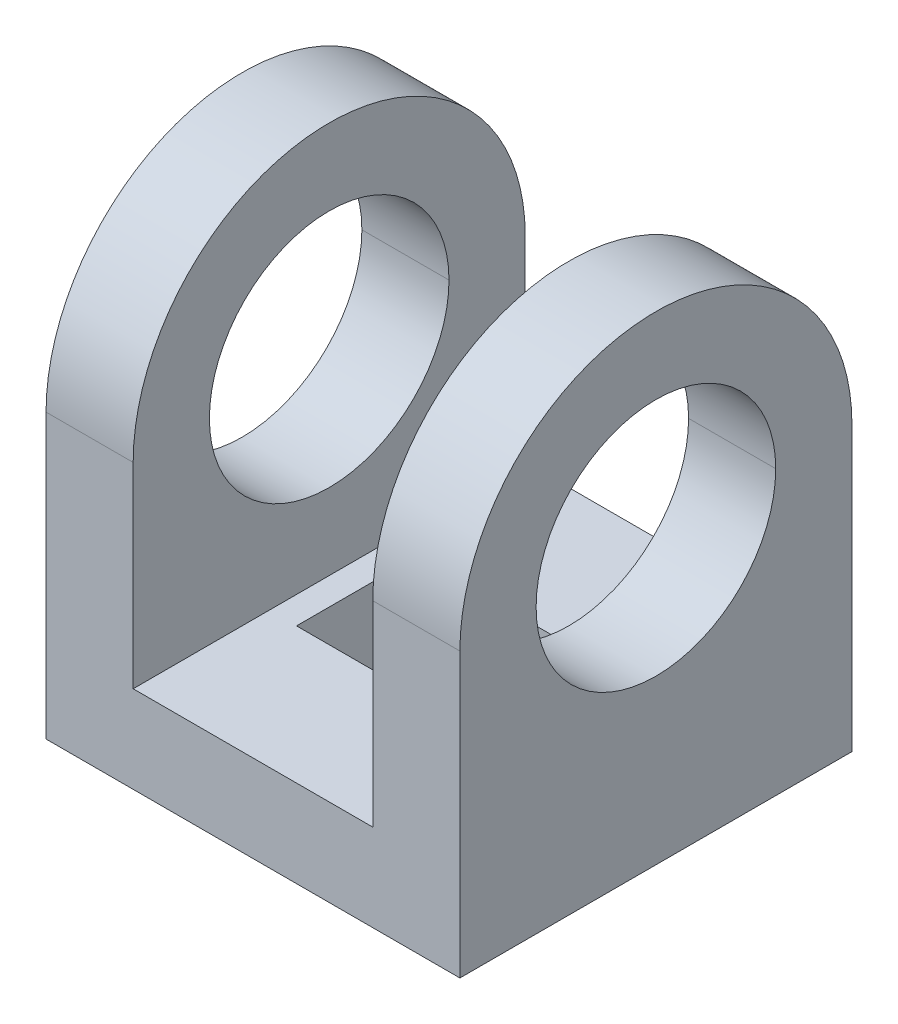
ISO-10303-21;
HEADER;
FILE_DESCRIPTION(('STEP AP214'),'2;1');
FILE_NAME('part.step','',(''),(''),'','','');
FILE_SCHEMA(('AUTOMOTIVE_DESIGN { 1 0 10303 214 1 1 1 1 }'));
ENDSEC;
DATA;
#1=APPLICATION_CONTEXT('core data for automotive mechanical design processes');
#2=APPLICATION_PROTOCOL_DEFINITION('international standard','automotive_design',2000,#1);
#3=PRODUCT_CONTEXT('',#1,'mechanical');
#4=PRODUCT('Part','Part','',(#3));
#5=PRODUCT_RELATED_PRODUCT_CATEGORY('part','',(#4));
#6=PRODUCT_DEFINITION_FORMATION('','',#4);
#7=PRODUCT_DEFINITION_CONTEXT('part definition',#1,'design');
#8=PRODUCT_DEFINITION('design','',#6,#7);
#9=PRODUCT_DEFINITION_SHAPE('','',#8);
#10=(LENGTH_UNIT() NAMED_UNIT(*) SI_UNIT(.MILLI.,.METRE.));
#11=(NAMED_UNIT(*) PLANE_ANGLE_UNIT() SI_UNIT($,.RADIAN.));
#12=(NAMED_UNIT(*) SI_UNIT($,.STERADIAN.) SOLID_ANGLE_UNIT());
#13=UNCERTAINTY_MEASURE_WITH_UNIT(LENGTH_MEASURE(1.E-05),#10,'distance_accuracy_value','');
#14=(GEOMETRIC_REPRESENTATION_CONTEXT(3) GLOBAL_UNCERTAINTY_ASSIGNED_CONTEXT((#13)) GLOBAL_UNIT_ASSIGNED_CONTEXT((#10,
#11,#12)) REPRESENTATION_CONTEXT('',''));
#15=CARTESIAN_POINT('',(0.,0.,0.));
#16=DIRECTION('',(0.,0.,1.));
#17=DIRECTION('',(1.,0.,0.));
#18=AXIS2_PLACEMENT_3D('',#15,#16,#17);
#19=CARTESIAN_POINT('',(5.25,22.,-11.75));
#20=DIRECTION('',(0.,0.,-1.));
#21=DIRECTION('',(-1.,0.,0.));
#22=AXIS2_PLACEMENT_3D('',#19,#20,#21);
#23=PLANE('',#22);
#24=DIRECTION('',(0.,-1.,0.));
#25=VECTOR('',#24,1.);
#26=CARTESIAN_POINT('',(5.25,22.,-11.75));
#27=LINE('',#26,#25);
#28=CARTESIAN_POINT('',(5.25,4.,-11.75));
#29=VERTEX_POINT('',#28);
#30=CARTESIAN_POINT('',(5.25,0.,-11.75));
#31=VERTEX_POINT('',#30);
#32=EDGE_CURVE('E191',#29,#31,#27,.T.);
#33=ORIENTED_EDGE('',*,*,#32,.T.);
#34=DIRECTION('',(1.,0.,0.));
#35=VECTOR('',#34,1.);
#36=CARTESIAN_POINT('',(5.25,0.,-11.75));
#37=LINE('',#36,#35);
#38=CARTESIAN_POINT('',(13.75,0.,-11.75));
#39=VERTEX_POINT('',#38);
#40=EDGE_CURVE('E206',#31,#39,#37,.T.);
#41=ORIENTED_EDGE('',*,*,#40,.T.);
#42=DIRECTION('',(0.,-1.,0.));
#43=VECTOR('',#42,1.);
#44=CARTESIAN_POINT('',(13.75,22.,-11.75));
#45=LINE('',#44,#43);
#46=CARTESIAN_POINT('',(13.75,4.,-11.75));
#47=VERTEX_POINT('',#46);
#48=EDGE_CURVE('E9',#47,#39,#45,.T.);
#49=ORIENTED_EDGE('',*,*,#48,.F.);
#50=DIRECTION('',(1.,0.,0.));
#51=VECTOR('',#50,1.);
#52=CARTESIAN_POINT('',(4.,4.,-11.75));
#53=LINE('',#52,#51);
#54=EDGE_CURVE('E290',#29,#47,#53,.T.);
#55=ORIENTED_EDGE('',*,*,#54,.F.);
#56=EDGE_LOOP('',(#33,#41,#49,#55));
#57=FACE_BOUND('',#56,.T.);
#58=ADVANCED_FACE('F14',(#57),#23,.F.);
#59=CARTESIAN_POINT('',(13.75,22.,-6.25));
#60=DIRECTION('',(1.,0.,0.));
#61=DIRECTION('',(0.,1.,0.));
#62=AXIS2_PLACEMENT_3D('',#59,#60,#61);
#63=PLANE('',#62);
#64=ORIENTED_EDGE('',*,*,#48,.T.);
#65=DIRECTION('',(0.,0.,1.));
#66=VECTOR('',#65,1.);
#67=CARTESIAN_POINT('',(13.75,0.,-6.25));
#68=LINE('',#67,#66);
#69=CARTESIAN_POINT('',(13.75,0.,-6.25));
#70=VERTEX_POINT('',#69);
#71=EDGE_CURVE('E201',#39,#70,#68,.T.);
#72=ORIENTED_EDGE('',*,*,#71,.T.);
#73=DIRECTION('',(0.,-1.,0.));
#74=VECTOR('',#73,1.);
#75=CARTESIAN_POINT('',(13.75,22.,-6.25));
#76=LINE('',#75,#74);
#77=CARTESIAN_POINT('',(13.75,4.,-6.25));
#78=VERTEX_POINT('',#77);
#79=EDGE_CURVE('E25',#78,#70,#76,.T.);
#80=ORIENTED_EDGE('',*,*,#79,.F.);
#81=DIRECTION('',(0.,0.,1.));
#82=VECTOR('',#81,1.);
#83=CARTESIAN_POINT('',(13.75,4.,-18.));
#84=LINE('',#83,#82);
#85=EDGE_CURVE('E192',#47,#78,#84,.T.);
#86=ORIENTED_EDGE('',*,*,#85,.F.);
#87=EDGE_LOOP('',(#64,#72,#80,#86));
#88=FACE_BOUND('',#87,.T.);
#89=ADVANCED_FACE('F457',(#88),#63,.F.);
#90=CARTESIAN_POINT('',(5.25,22.,-6.25));
#91=DIRECTION('',(0.,0.,1.));
#92=DIRECTION('',(1.,0.,0.));
#93=AXIS2_PLACEMENT_3D('',#90,#91,#92);
#94=PLANE('',#93);
#95=ORIENTED_EDGE('',*,*,#79,.T.);
#96=DIRECTION('',(-1.,0.,0.));
#97=VECTOR('',#96,1.);
#98=CARTESIAN_POINT('',(5.25,0.,-6.25));
#99=LINE('',#98,#97);
#100=CARTESIAN_POINT('',(5.25,0.,-6.25));
#101=VERTEX_POINT('',#100);
#102=EDGE_CURVE('E195',#70,#101,#99,.T.);
#103=ORIENTED_EDGE('',*,*,#102,.T.);
#104=DIRECTION('',(0.,-1.,0.));
#105=VECTOR('',#104,1.);
#106=CARTESIAN_POINT('',(5.25,22.,-6.25));
#107=LINE('',#106,#105);
#108=CARTESIAN_POINT('',(5.25,4.,-6.25));
#109=VERTEX_POINT('',#108);
#110=EDGE_CURVE('E180',#109,#101,#107,.T.);
#111=ORIENTED_EDGE('',*,*,#110,.F.);
#112=DIRECTION('',(-1.,0.,0.));
#113=VECTOR('',#112,1.);
#114=CARTESIAN_POINT('',(4.,4.,-6.25));
#115=LINE('',#114,#113);
#116=EDGE_CURVE('E284',#78,#109,#115,.T.);
#117=ORIENTED_EDGE('',*,*,#116,.F.);
#118=EDGE_LOOP('',(#95,#103,#111,#117));
#119=FACE_BOUND('',#118,.T.);
#120=ADVANCED_FACE('F196',(#119),#94,.F.);
#121=CARTESIAN_POINT('',(5.25,22.,-6.25));
#122=DIRECTION('',(-1.,0.,0.));
#123=DIRECTION('',(0.,0.,1.));
#124=AXIS2_PLACEMENT_3D('',#121,#122,#123);
#125=PLANE('',#124);
#126=ORIENTED_EDGE('',*,*,#110,.T.);
#127=DIRECTION('',(0.,0.,-1.));
#128=VECTOR('',#127,1.);
#129=CARTESIAN_POINT('',(5.25,0.,-6.25));
#130=LINE('',#129,#128);
#131=EDGE_CURVE('E184',#101,#31,#130,.T.);
#132=ORIENTED_EDGE('',*,*,#131,.T.);
#133=ORIENTED_EDGE('',*,*,#32,.F.);
#134=DIRECTION('',(0.,0.,-1.));
#135=VECTOR('',#134,1.);
#136=CARTESIAN_POINT('',(5.25,4.,-18.));
#137=LINE('',#136,#135);
#138=EDGE_CURVE('E186',#109,#29,#137,.T.);
#139=ORIENTED_EDGE('',*,*,#138,.F.);
#140=EDGE_LOOP('',(#126,#132,#133,#139));
#141=FACE_BOUND('',#140,.T.);
#142=ADVANCED_FACE('F182',(#141),#125,.F.);
#143=CARTESIAN_POINT('',(4.,4.,-18.));
#144=DIRECTION('',(0.,-1.,0.));
#145=DIRECTION('',(0.,0.,-1.));
#146=AXIS2_PLACEMENT_3D('',#143,#144,#145);
#147=PLANE('',#146);
#148=ORIENTED_EDGE('',*,*,#116,.T.);
#149=ORIENTED_EDGE('',*,*,#138,.T.);
#150=ORIENTED_EDGE('',*,*,#54,.T.);
#151=ORIENTED_EDGE('',*,*,#85,.T.);
#152=EDGE_LOOP('',(#148,#149,#150,#151));
#153=FACE_BOUND('',#152,.T.);
#154=DIRECTION('',(1.,0.,0.));
#155=VECTOR('',#154,1.);
#156=CARTESIAN_POINT('',(4.,4.,0.));
#157=LINE('',#156,#155);
#158=CARTESIAN_POINT('',(4.,4.,0.));
#159=VERTEX_POINT('',#158);
#160=CARTESIAN_POINT('',(15.,4.,0.));
#161=VERTEX_POINT('',#160);
#162=EDGE_CURVE('E334',#159,#161,#157,.T.);
#163=ORIENTED_EDGE('',*,*,#162,.T.);
#164=DIRECTION('',(0.,0.,1.));
#165=VECTOR('',#164,1.);
#166=CARTESIAN_POINT('',(15.,4.,-18.));
#167=LINE('',#166,#165);
#168=CARTESIAN_POINT('',(15.,4.,-18.));
#169=VERTEX_POINT('',#168);
#170=EDGE_CURVE('E151',#169,#161,#167,.T.);
#171=ORIENTED_EDGE('',*,*,#170,.F.);
#172=DIRECTION('',(1.,0.,0.));
#173=VECTOR('',#172,1.);
#174=CARTESIAN_POINT('',(4.,4.,-18.));
#175=LINE('',#174,#173);
#176=CARTESIAN_POINT('',(4.,4.,-18.));
#177=VERTEX_POINT('',#176);
#178=EDGE_CURVE('E268',#177,#169,#175,.T.);
#179=ORIENTED_EDGE('',*,*,#178,.F.);
#180=DIRECTION('',(0.,0.,1.));
#181=VECTOR('',#180,1.);
#182=CARTESIAN_POINT('',(4.,4.,-18.));
#183=LINE('',#182,#181);
#184=EDGE_CURVE('E138',#177,#159,#183,.T.);
#185=ORIENTED_EDGE('',*,*,#184,.T.);
#186=EDGE_LOOP('',(#163,#171,#179,#185));
#187=FACE_BOUND('',#186,.T.);
#188=ADVANCED_FACE('F373',(#153,#187),#147,.F.);
#189=CARTESIAN_POINT('',(15.,4.,-18.));
#190=DIRECTION('',(1.,0.,0.));
#191=DIRECTION('',(0.,1.,0.));
#192=AXIS2_PLACEMENT_3D('',#189,#190,#191);
#193=PLANE('',#192);
#194=CARTESIAN_POINT('',(15.,13.,-9.));
#195=DIRECTION('',(-1.,0.,0.));
#196=DIRECTION('',(0.,1.,0.));
#197=AXIS2_PLACEMENT_3D('',#194,#195,#196);
#198=CIRCLE('',#197,5.5);
#199=CARTESIAN_POINT('',(15.,13.,-3.5));
#200=VERTEX_POINT('',#199);
#201=CARTESIAN_POINT('',(15.,13.,-14.5));
#202=VERTEX_POINT('',#201);
#203=EDGE_CURVE('E281',#200,#202,#198,.T.);
#204=ORIENTED_EDGE('',*,*,#203,.F.);
#205=CARTESIAN_POINT('',(15.,13.,-9.));
#206=DIRECTION('',(-1.,0.,0.));
#207=DIRECTION('',(0.,1.,0.));
#208=AXIS2_PLACEMENT_3D('',#205,#206,#207);
#209=CIRCLE('',#208,5.5);
#210=EDGE_CURVE('E224',#202,#200,#209,.T.);
#211=ORIENTED_EDGE('',*,*,#210,.F.);
#212=EDGE_LOOP('',(#204,#211));
#213=FACE_BOUND('',#212,.T.);
#214=CARTESIAN_POINT('',(15.,13.,-9.));
#215=DIRECTION('',(-1.,0.,0.));
#216=DIRECTION('',(0.,1.,0.));
#217=AXIS2_PLACEMENT_3D('',#214,#215,#216);
#218=CIRCLE('',#217,9.);
#219=CARTESIAN_POINT('',(15.,13.,0.));
#220=VERTEX_POINT('',#219);
#221=CARTESIAN_POINT('',(15.,13.,-18.));
#222=VERTEX_POINT('',#221);
#223=EDGE_CURVE('E170',#220,#222,#218,.T.);
#224=ORIENTED_EDGE('',*,*,#223,.T.);
#225=DIRECTION('',(0.,1.,0.));
#226=VECTOR('',#225,1.);
#227=CARTESIAN_POINT('',(15.,4.,-18.));
#228=LINE('',#227,#226);
#229=EDGE_CURVE('E264',#169,#222,#228,.T.);
#230=ORIENTED_EDGE('',*,*,#229,.F.);
#231=ORIENTED_EDGE('',*,*,#170,.T.);
#232=DIRECTION('',(0.,1.,0.));
#233=VECTOR('',#232,1.);
#234=CARTESIAN_POINT('',(15.,4.,0.));
#235=LINE('',#234,#233);
#236=EDGE_CURVE('E235',#161,#220,#235,.T.);
#237=ORIENTED_EDGE('',*,*,#236,.T.);
#238=EDGE_LOOP('',(#224,#230,#231,#237));
#239=FACE_BOUND('',#238,.T.);
#240=ADVANCED_FACE('F378',(#213,#239),#193,.F.);
#241=CARTESIAN_POINT('',(4.,4.,-18.));
#242=DIRECTION('',(-1.,0.,0.));
#243=DIRECTION('',(0.,0.,1.));
#244=AXIS2_PLACEMENT_3D('',#241,#242,#243);
#245=PLANE('',#244);
#246=CARTESIAN_POINT('',(4.,13.,-9.));
#247=DIRECTION('',(1.,0.,0.));
#248=DIRECTION('',(0.,0.,1.));
#249=AXIS2_PLACEMENT_3D('',#246,#247,#248);
#250=CIRCLE('',#249,5.5);
#251=CARTESIAN_POINT('',(4.,13.,-3.5));
#252=VERTEX_POINT('',#251);
#253=CARTESIAN_POINT('',(4.,13.,-14.5));
#254=VERTEX_POINT('',#253);
#255=EDGE_CURVE('E223',#252,#254,#250,.T.);
#256=ORIENTED_EDGE('',*,*,#255,.F.);
#257=CARTESIAN_POINT('',(4.,13.,-9.));
#258=DIRECTION('',(1.,0.,0.));
#259=DIRECTION('',(0.,0.,1.));
#260=AXIS2_PLACEMENT_3D('',#257,#258,#259);
#261=CIRCLE('',#260,5.5);
#262=EDGE_CURVE('E259',#254,#252,#261,.T.);
#263=ORIENTED_EDGE('',*,*,#262,.F.);
#264=EDGE_LOOP('',(#256,#263));
#265=FACE_BOUND('',#264,.T.);
#266=CARTESIAN_POINT('',(4.,13.,-9.));
#267=DIRECTION('',(1.,0.,0.));
#268=DIRECTION('',(0.,0.,1.));
#269=AXIS2_PLACEMENT_3D('',#266,#267,#268);
#270=CIRCLE('',#269,9.);
#271=CARTESIAN_POINT('',(4.,13.,-18.));
#272=VERTEX_POINT('',#271);
#273=CARTESIAN_POINT('',(4.,13.,0.));
#274=VERTEX_POINT('',#273);
#275=EDGE_CURVE('E253',#272,#274,#270,.T.);
#276=ORIENTED_EDGE('',*,*,#275,.T.);
#277=DIRECTION('',(0.,-1.,0.));
#278=VECTOR('',#277,1.);
#279=CARTESIAN_POINT('',(4.,4.,0.));
#280=LINE('',#279,#278);
#281=EDGE_CURVE('E234',#274,#159,#280,.T.);
#282=ORIENTED_EDGE('',*,*,#281,.T.);
#283=ORIENTED_EDGE('',*,*,#184,.F.);
#284=DIRECTION('',(0.,-1.,0.));
#285=VECTOR('',#284,1.);
#286=CARTESIAN_POINT('',(4.,4.,-18.));
#287=LINE('',#286,#285);
#288=EDGE_CURVE('E277',#272,#177,#287,.T.);
#289=ORIENTED_EDGE('',*,*,#288,.F.);
#290=EDGE_LOOP('',(#276,#282,#283,#289));
#291=FACE_BOUND('',#290,.T.);
#292=ADVANCED_FACE('F430',(#265,#291),#245,.F.);
#293=CARTESIAN_POINT('',(19.,13.,-9.));
#294=DIRECTION('',(-1.,0.,0.));
#295=DIRECTION('',(0.,0.,1.));
#296=AXIS2_PLACEMENT_3D('',#293,#294,#295);
#297=CYLINDRICAL_SURFACE('',#296,5.5);
#298=DIRECTION('',(-1.,0.,0.));
#299=VECTOR('',#298,1.);
#300=CARTESIAN_POINT('',(19.,13.,-14.5));
#301=LINE('',#300,#299);
#302=CARTESIAN_POINT('',(19.,13.,-14.5));
#303=VERTEX_POINT('',#302);
#304=EDGE_CURVE('E228',#303,#202,#301,.T.);
#305=ORIENTED_EDGE('',*,*,#304,.F.);
#306=CARTESIAN_POINT('',(19.,13.,-9.));
#307=DIRECTION('',(-1.,0.,0.));
#308=DIRECTION('',(0.,0.,1.));
#309=AXIS2_PLACEMENT_3D('',#306,#307,#308);
#310=CIRCLE('',#309,5.5);
#311=CARTESIAN_POINT('',(19.,13.,-3.5));
#312=VERTEX_POINT('',#311);
#313=EDGE_CURVE('E304',#312,#303,#310,.T.);
#314=ORIENTED_EDGE('',*,*,#313,.F.);
#315=DIRECTION('',(-1.,0.,0.));
#316=VECTOR('',#315,1.);
#317=CARTESIAN_POINT('',(19.,13.,-3.5));
#318=LINE('',#317,#316);
#319=EDGE_CURVE('E220',#312,#200,#318,.T.);
#320=ORIENTED_EDGE('',*,*,#319,.T.);
#321=ORIENTED_EDGE('',*,*,#203,.T.);
#322=EDGE_LOOP('',(#305,#314,#320,#321));
#323=FACE_BOUND('',#322,.T.);
#324=ADVANCED_FACE('F435',(#323),#297,.F.);
#325=CARTESIAN_POINT('',(19.,13.,-9.));
#326=DIRECTION('',(-1.,0.,0.));
#327=DIRECTION('',(0.,0.,1.));
#328=AXIS2_PLACEMENT_3D('',#325,#326,#327);
#329=CYLINDRICAL_SURFACE('',#328,9.);
#330=ORIENTED_EDGE('',*,*,#223,.F.);
#331=DIRECTION('',(-1.,0.,0.));
#332=VECTOR('',#331,1.);
#333=CARTESIAN_POINT('',(19.,13.,0.));
#334=LINE('',#333,#332);
#335=CARTESIAN_POINT('',(19.,13.,0.));
#336=VERTEX_POINT('',#335);
#337=EDGE_CURVE('E239',#336,#220,#334,.T.);
#338=ORIENTED_EDGE('',*,*,#337,.F.);
#339=CARTESIAN_POINT('',(19.,13.,-9.));
#340=DIRECTION('',(-1.,0.,0.));
#341=DIRECTION('',(0.,0.,1.));
#342=AXIS2_PLACEMENT_3D('',#339,#340,#341);
#343=CIRCLE('',#342,9.);
#344=CARTESIAN_POINT('',(19.,13.,-18.));
#345=VERTEX_POINT('',#344);
#346=EDGE_CURVE('E320',#336,#345,#343,.T.);
#347=ORIENTED_EDGE('',*,*,#346,.T.);
#348=DIRECTION('',(-1.,0.,0.));
#349=VECTOR('',#348,1.);
#350=CARTESIAN_POINT('',(19.,13.,-18.));
#351=LINE('',#350,#349);
#352=EDGE_CURVE('E215',#345,#222,#351,.T.);
#353=ORIENTED_EDGE('',*,*,#352,.T.);
#354=EDGE_LOOP('',(#330,#338,#347,#353));
#355=FACE_BOUND('',#354,.T.);
#356=ADVANCED_FACE('F480',(#355),#329,.T.);
#357=CARTESIAN_POINT('',(0.,0.,0.));
#358=DIRECTION('',(0.,-1.,0.));
#359=DIRECTION('',(0.,0.,-1.));
#360=AXIS2_PLACEMENT_3D('',#357,#358,#359);
#361=PLANE('',#360);
#362=ORIENTED_EDGE('',*,*,#131,.F.);
#363=ORIENTED_EDGE('',*,*,#102,.F.);
#364=ORIENTED_EDGE('',*,*,#71,.F.);
#365=ORIENTED_EDGE('',*,*,#40,.F.);
#366=EDGE_LOOP('',(#362,#363,#364,#365));
#367=FACE_BOUND('',#366,.T.);
#368=DIRECTION('',(0.,0.,1.));
#369=VECTOR('',#368,1.);
#370=CARTESIAN_POINT('',(0.,0.,0.));
#371=LINE('',#370,#369);
#372=CARTESIAN_POINT('',(0.,0.,-18.));
#373=VERTEX_POINT('',#372);
#374=CARTESIAN_POINT('',(0.,0.,0.));
#375=VERTEX_POINT('',#374);
#376=EDGE_CURVE('E18',#373,#375,#371,.T.);
#377=ORIENTED_EDGE('',*,*,#376,.F.);
#378=DIRECTION('',(-1.,0.,0.));
#379=VECTOR('',#378,1.);
#380=CARTESIAN_POINT('',(0.,0.,-18.));
#381=LINE('',#380,#379);
#382=CARTESIAN_POINT('',(19.,0.,-18.));
#383=VERTEX_POINT('',#382);
#384=EDGE_CURVE('E208',#383,#373,#381,.T.);
#385=ORIENTED_EDGE('',*,*,#384,.F.);
#386=DIRECTION('',(0.,0.,-1.));
#387=VECTOR('',#386,1.);
#388=CARTESIAN_POINT('',(19.,0.,0.));
#389=LINE('',#388,#387);
#390=CARTESIAN_POINT('',(19.,0.,0.));
#391=VERTEX_POINT('',#390);
#392=EDGE_CURVE('E238',#391,#383,#389,.T.);
#393=ORIENTED_EDGE('',*,*,#392,.F.);
#394=DIRECTION('',(1.,0.,0.));
#395=VECTOR('',#394,1.);
#396=CARTESIAN_POINT('',(0.,0.,0.));
#397=LINE('',#396,#395);
#398=EDGE_CURVE('E229',#375,#391,#397,.T.);
#399=ORIENTED_EDGE('',*,*,#398,.F.);
#400=EDGE_LOOP('',(#377,#385,#393,#399));
#401=FACE_BOUND('',#400,.T.);
#402=ADVANCED_FACE('F204',(#367,#401),#361,.T.);
#403=CARTESIAN_POINT('',(0.,4.,-18.));
#404=DIRECTION('',(0.,0.,1.));
#405=DIRECTION('',(1.,0.,0.));
#406=AXIS2_PLACEMENT_3D('',#403,#404,#405);
#407=PLANE('',#406);
#408=DIRECTION('',(-1.,0.,0.));
#409=VECTOR('',#408,1.);
#410=CARTESIAN_POINT('',(19.,13.,-18.));
#411=LINE('',#410,#409);
#412=CARTESIAN_POINT('',(0.,13.,-18.));
#413=VERTEX_POINT('',#412);
#414=EDGE_CURVE('E327',#272,#413,#411,.T.);
#415=ORIENTED_EDGE('',*,*,#414,.F.);
#416=ORIENTED_EDGE('',*,*,#288,.T.);
#417=ORIENTED_EDGE('',*,*,#178,.T.);
#418=ORIENTED_EDGE('',*,*,#229,.T.);
#419=ORIENTED_EDGE('',*,*,#352,.F.);
#420=DIRECTION('',(0.,-1.,0.));
#421=VECTOR('',#420,1.);
#422=CARTESIAN_POINT('',(19.,4.,-18.));
#423=LINE('',#422,#421);
#424=EDGE_CURVE('E258',#345,#383,#423,.T.);
#425=ORIENTED_EDGE('',*,*,#424,.T.);
#426=ORIENTED_EDGE('',*,*,#384,.T.);
#427=DIRECTION('',(0.,-1.,0.));
#428=VECTOR('',#427,1.);
#429=CARTESIAN_POINT('',(0.,4.,-18.));
#430=LINE('',#429,#428);
#431=EDGE_CURVE('E248',#413,#373,#430,.T.);
#432=ORIENTED_EDGE('',*,*,#431,.F.);
#433=EDGE_LOOP('',(#415,#416,#417,#418,#419,#425,#426,#432));
#434=FACE_BOUND('',#433,.T.);
#435=ADVANCED_FACE('F358',(#434),#407,.F.);
#436=CARTESIAN_POINT('',(19.,4.,0.));
#437=DIRECTION('',(-1.,0.,0.));
#438=DIRECTION('',(0.,0.,1.));
#439=AXIS2_PLACEMENT_3D('',#436,#437,#438);
#440=PLANE('',#439);
#441=ORIENTED_EDGE('',*,*,#313,.T.);
#442=CARTESIAN_POINT('',(19.,13.,-9.));
#443=DIRECTION('',(-1.,0.,0.));
#444=DIRECTION('',(0.,0.,1.));
#445=AXIS2_PLACEMENT_3D('',#442,#443,#444);
#446=CIRCLE('',#445,5.5);
#447=EDGE_CURVE('E240',#303,#312,#446,.T.);
#448=ORIENTED_EDGE('',*,*,#447,.T.);
#449=EDGE_LOOP('',(#441,#448));
#450=FACE_BOUND('',#449,.T.);
#451=ORIENTED_EDGE('',*,*,#392,.T.);
#452=ORIENTED_EDGE('',*,*,#424,.F.);
#453=ORIENTED_EDGE('',*,*,#346,.F.);
#454=DIRECTION('',(0.,-1.,0.));
#455=VECTOR('',#454,1.);
#456=CARTESIAN_POINT('',(19.,4.,0.));
#457=LINE('',#456,#455);
#458=EDGE_CURVE('E233',#336,#391,#457,.T.);
#459=ORIENTED_EDGE('',*,*,#458,.T.);
#460=EDGE_LOOP('',(#451,#452,#453,#459));
#461=FACE_BOUND('',#460,.T.);
#462=ADVANCED_FACE('F360',(#450,#461),#440,.F.);
#463=CARTESIAN_POINT('',(0.,4.,0.));
#464=DIRECTION('',(0.,0.,-1.));
#465=DIRECTION('',(0.,-1.,0.));
#466=AXIS2_PLACEMENT_3D('',#463,#464,#465);
#467=PLANE('',#466);
#468=ORIENTED_EDGE('',*,*,#162,.F.);
#469=ORIENTED_EDGE('',*,*,#281,.F.);
#470=DIRECTION('',(-1.,0.,0.));
#471=VECTOR('',#470,1.);
#472=CARTESIAN_POINT('',(19.,13.,0.));
#473=LINE('',#472,#471);
#474=CARTESIAN_POINT('',(0.,13.,0.));
#475=VERTEX_POINT('',#474);
#476=EDGE_CURVE('E263',#274,#475,#473,.T.);
#477=ORIENTED_EDGE('',*,*,#476,.T.);
#478=DIRECTION('',(0.,-1.,0.));
#479=VECTOR('',#478,1.);
#480=CARTESIAN_POINT('',(0.,4.,0.));
#481=LINE('',#480,#479);
#482=EDGE_CURVE('E244',#475,#375,#481,.T.);
#483=ORIENTED_EDGE('',*,*,#482,.T.);
#484=ORIENTED_EDGE('',*,*,#398,.T.);
#485=ORIENTED_EDGE('',*,*,#458,.F.);
#486=ORIENTED_EDGE('',*,*,#337,.T.);
#487=ORIENTED_EDGE('',*,*,#236,.F.);
#488=EDGE_LOOP('',(#468,#469,#477,#483,#484,#485,#486,#487));
#489=FACE_BOUND('',#488,.T.);
#490=ADVANCED_FACE('F406',(#489),#467,.F.);
#491=CARTESIAN_POINT('',(0.,4.,0.));
#492=DIRECTION('',(1.,0.,0.));
#493=DIRECTION('',(0.,1.,0.));
#494=AXIS2_PLACEMENT_3D('',#491,#492,#493);
#495=PLANE('',#494);
#496=CARTESIAN_POINT('',(0.,13.,-9.));
#497=DIRECTION('',(-1.,0.,0.));
#498=DIRECTION('',(0.,0.,1.));
#499=AXIS2_PLACEMENT_3D('',#496,#497,#498);
#500=CIRCLE('',#499,5.5);
#501=CARTESIAN_POINT('',(0.,13.,-3.5));
#502=VERTEX_POINT('',#501);
#503=CARTESIAN_POINT('',(0.,13.,-14.5));
#504=VERTEX_POINT('',#503);
#505=EDGE_CURVE('E262',#502,#504,#500,.T.);
#506=ORIENTED_EDGE('',*,*,#505,.F.);
#507=CARTESIAN_POINT('',(0.,13.,-9.));
#508=DIRECTION('',(-1.,0.,0.));
#509=DIRECTION('',(0.,0.,1.));
#510=AXIS2_PLACEMENT_3D('',#507,#508,#509);
#511=CIRCLE('',#510,5.5);
#512=EDGE_CURVE('E254',#504,#502,#511,.T.);
#513=ORIENTED_EDGE('',*,*,#512,.F.);
#514=EDGE_LOOP('',(#506,#513));
#515=FACE_BOUND('',#514,.T.);
#516=ORIENTED_EDGE('',*,*,#376,.T.);
#517=ORIENTED_EDGE('',*,*,#482,.F.);
#518=CARTESIAN_POINT('',(0.,13.,-9.));
#519=DIRECTION('',(-1.,0.,0.));
#520=DIRECTION('',(0.,0.,1.));
#521=AXIS2_PLACEMENT_3D('',#518,#519,#520);
#522=CIRCLE('',#521,9.);
#523=EDGE_CURVE('E314',#475,#413,#522,.T.);
#524=ORIENTED_EDGE('',*,*,#523,.T.);
#525=ORIENTED_EDGE('',*,*,#431,.T.);
#526=EDGE_LOOP('',(#516,#517,#524,#525));
#527=FACE_BOUND('',#526,.T.);
#528=ADVANCED_FACE('F416',(#515,#527),#495,.F.);
#529=CARTESIAN_POINT('',(19.,13.,-9.));
#530=DIRECTION('',(-1.,0.,0.));
#531=DIRECTION('',(0.,0.,1.));
#532=AXIS2_PLACEMENT_3D('',#529,#530,#531);
#533=CYLINDRICAL_SURFACE('',#532,5.5);
#534=DIRECTION('',(-1.,0.,0.));
#535=VECTOR('',#534,1.);
#536=CARTESIAN_POINT('',(19.,13.,-14.5));
#537=LINE('',#536,#535);
#538=EDGE_CURVE('E308',#254,#504,#537,.T.);
#539=ORIENTED_EDGE('',*,*,#538,.F.);
#540=ORIENTED_EDGE('',*,*,#262,.T.);
#541=DIRECTION('',(-1.,0.,0.));
#542=VECTOR('',#541,1.);
#543=CARTESIAN_POINT('',(19.,13.,-3.5));
#544=LINE('',#543,#542);
#545=EDGE_CURVE('E249',#252,#502,#544,.T.);
#546=ORIENTED_EDGE('',*,*,#545,.T.);
#547=ORIENTED_EDGE('',*,*,#505,.T.);
#548=EDGE_LOOP('',(#539,#540,#546,#547));
#549=FACE_BOUND('',#548,.T.);
#550=ADVANCED_FACE('F421',(#549),#533,.F.);
#551=CARTESIAN_POINT('',(19.,13.,-9.));
#552=DIRECTION('',(-1.,0.,0.));
#553=DIRECTION('',(0.,0.,1.));
#554=AXIS2_PLACEMENT_3D('',#551,#552,#553);
#555=CYLINDRICAL_SURFACE('',#554,9.);
#556=ORIENTED_EDGE('',*,*,#275,.F.);
#557=ORIENTED_EDGE('',*,*,#414,.T.);
#558=ORIENTED_EDGE('',*,*,#523,.F.);
#559=ORIENTED_EDGE('',*,*,#476,.F.);
#560=EDGE_LOOP('',(#556,#557,#558,#559));
#561=FACE_BOUND('',#560,.T.);
#562=ADVANCED_FACE('F488',(#561),#555,.T.);
#563=CARTESIAN_POINT('',(19.,13.,-9.));
#564=DIRECTION('',(-1.,0.,0.));
#565=DIRECTION('',(0.,0.,1.));
#566=AXIS2_PLACEMENT_3D('',#563,#564,#565);
#567=CYLINDRICAL_SURFACE('',#566,5.5);
#568=ORIENTED_EDGE('',*,*,#255,.T.);
#569=ORIENTED_EDGE('',*,*,#538,.T.);
#570=ORIENTED_EDGE('',*,*,#512,.T.);
#571=ORIENTED_EDGE('',*,*,#545,.F.);
#572=EDGE_LOOP('',(#568,#569,#570,#571));
#573=FACE_BOUND('',#572,.T.);
#574=ADVANCED_FACE('F16',(#573),#567,.F.);
#575=CARTESIAN_POINT('',(19.,13.,-9.));
#576=DIRECTION('',(-1.,0.,0.));
#577=DIRECTION('',(0.,0.,1.));
#578=AXIS2_PLACEMENT_3D('',#575,#576,#577);
#579=CYLINDRICAL_SURFACE('',#578,5.5);
#580=ORIENTED_EDGE('',*,*,#447,.F.);
#581=ORIENTED_EDGE('',*,*,#304,.T.);
#582=ORIENTED_EDGE('',*,*,#210,.T.);
#583=ORIENTED_EDGE('',*,*,#319,.F.);
#584=EDGE_LOOP('',(#580,#581,#582,#583));
#585=FACE_BOUND('',#584,.T.);
#586=ADVANCED_FACE('F389',(#585),#579,.F.);
#587=CLOSED_SHELL('',(#58,#89,#120,#142,#188,#240,#292,#324,#356,#402,#435,#462,#490,#528,#550,
#562,#574,#586));
#588=MANIFOLD_SOLID_BREP('B1',#587);
#589=ADVANCED_BREP_SHAPE_REPRESENTATION('',(#18,#588),#14);
#590=SHAPE_DEFINITION_REPRESENTATION(#9,#589);
ENDSEC;
END-ISO-10303-21;
